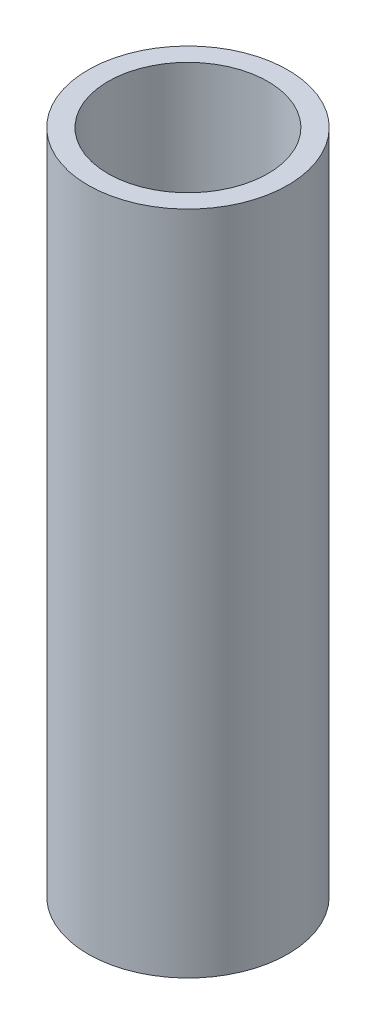
ISO-10303-21;
HEADER;
FILE_DESCRIPTION(('STEP AP214'),'2;1');
FILE_NAME('part.step','',(''),(''),'','','');
FILE_SCHEMA(('AUTOMOTIVE_DESIGN { 1 0 10303 214 1 1 1 1 }'));
ENDSEC;
DATA;
#1=APPLICATION_CONTEXT('core data for automotive mechanical design processes');
#2=APPLICATION_PROTOCOL_DEFINITION('international standard','automotive_design',2000,#1);
#3=PRODUCT_CONTEXT('',#1,'mechanical');
#4=PRODUCT('Part','Part','',(#3));
#5=PRODUCT_RELATED_PRODUCT_CATEGORY('part','',(#4));
#6=PRODUCT_DEFINITION_FORMATION('','',#4);
#7=PRODUCT_DEFINITION_CONTEXT('part definition',#1,'design');
#8=PRODUCT_DEFINITION('design','',#6,#7);
#9=PRODUCT_DEFINITION_SHAPE('','',#8);
#10=(LENGTH_UNIT() NAMED_UNIT(*) SI_UNIT(.MILLI.,.METRE.));
#11=(NAMED_UNIT(*) PLANE_ANGLE_UNIT() SI_UNIT($,.RADIAN.));
#12=(NAMED_UNIT(*) SI_UNIT($,.STERADIAN.) SOLID_ANGLE_UNIT());
#13=UNCERTAINTY_MEASURE_WITH_UNIT(LENGTH_MEASURE(1.E-05),#10,'distance_accuracy_value','');
#14=(GEOMETRIC_REPRESENTATION_CONTEXT(3) GLOBAL_UNCERTAINTY_ASSIGNED_CONTEXT((#13)) GLOBAL_UNIT_ASSIGNED_CONTEXT((#10,
#11,#12)) REPRESENTATION_CONTEXT('',''));
#15=CARTESIAN_POINT('',(0.,0.,0.));
#16=DIRECTION('',(0.,0.,1.));
#17=DIRECTION('',(1.,0.,0.));
#18=AXIS2_PLACEMENT_3D('',#15,#16,#17);
#19=CARTESIAN_POINT('',(0.,100.,0.));
#20=DIRECTION('',(0.,1.,0.));
#21=DIRECTION('',(0.,0.,1.));
#22=AXIS2_PLACEMENT_3D('',#19,#20,#21);
#23=PLANE('',#22);
#24=CARTESIAN_POINT('',(0.,100.,0.));
#25=DIRECTION('',(0.,1.,0.));
#26=DIRECTION('',(0.,0.,1.));
#27=AXIS2_PLACEMENT_3D('',#24,#25,#26);
#28=CIRCLE('',#27,15.);
#29=CARTESIAN_POINT('',(0.,100.,15.));
#30=VERTEX_POINT('',#29);
#31=EDGE_CURVE('E10',#30,#30,#28,.T.);
#32=ORIENTED_EDGE('',*,*,#31,.T.);
#33=EDGE_LOOP('',(#32));
#34=FACE_BOUND('',#33,.T.);
#35=CARTESIAN_POINT('',(0.,100.,0.));
#36=DIRECTION('',(0.,1.,0.));
#37=DIRECTION('',(0.,0.,1.));
#38=AXIS2_PLACEMENT_3D('',#35,#36,#37);
#39=CIRCLE('',#38,12.);
#40=CARTESIAN_POINT('',(0.,100.,12.));
#41=VERTEX_POINT('',#40);
#42=EDGE_CURVE('E54',#41,#41,#39,.T.);
#43=ORIENTED_EDGE('',*,*,#42,.F.);
#44=EDGE_LOOP('',(#43));
#45=FACE_BOUND('',#44,.T.);
#46=ADVANCED_FACE('F41',(#34,#45),#23,.T.);
#47=CARTESIAN_POINT('',(0.,0.,0.));
#48=DIRECTION('',(0.,1.,0.));
#49=DIRECTION('',(0.,0.,1.));
#50=AXIS2_PLACEMENT_3D('',#47,#48,#49);
#51=PLANE('',#50);
#52=CARTESIAN_POINT('',(0.,0.,0.));
#53=DIRECTION('',(0.,1.,0.));
#54=DIRECTION('',(0.,0.,1.));
#55=AXIS2_PLACEMENT_3D('',#52,#53,#54);
#56=CIRCLE('',#55,15.);
#57=CARTESIAN_POINT('',(0.,0.,15.));
#58=VERTEX_POINT('',#57);
#59=EDGE_CURVE('E45',#58,#58,#56,.T.);
#60=ORIENTED_EDGE('',*,*,#59,.F.);
#61=EDGE_LOOP('',(#60));
#62=FACE_BOUND('',#61,.T.);
#63=CARTESIAN_POINT('',(0.,0.,0.));
#64=DIRECTION('',(0.,1.,0.));
#65=DIRECTION('',(0.,0.,1.));
#66=AXIS2_PLACEMENT_3D('',#63,#64,#65);
#67=CIRCLE('',#66,12.);
#68=CARTESIAN_POINT('',(0.,0.,12.));
#69=VERTEX_POINT('',#68);
#70=EDGE_CURVE('E56',#69,#69,#67,.T.);
#71=ORIENTED_EDGE('',*,*,#70,.T.);
#72=EDGE_LOOP('',(#71));
#73=FACE_BOUND('',#72,.T.);
#74=ADVANCED_FACE('F68',(#62,#73),#51,.F.);
#75=CARTESIAN_POINT('',(0.,100.,0.));
#76=DIRECTION('',(0.,-1.,0.));
#77=DIRECTION('',(0.,0.,-1.));
#78=AXIS2_PLACEMENT_3D('',#75,#76,#77);
#79=CYLINDRICAL_SURFACE('',#78,15.);
#80=ORIENTED_EDGE('',*,*,#31,.F.);
#81=EDGE_LOOP('',(#80));
#82=FACE_BOUND('',#81,.T.);
#83=ORIENTED_EDGE('',*,*,#59,.T.);
#84=EDGE_LOOP('',(#83));
#85=FACE_BOUND('',#84,.T.);
#86=ADVANCED_FACE('F43',(#82,#85),#79,.T.);
#87=CARTESIAN_POINT('',(0.,100.,0.));
#88=DIRECTION('',(0.,-1.,0.));
#89=DIRECTION('',(0.,0.,-1.));
#90=AXIS2_PLACEMENT_3D('',#87,#88,#89);
#91=CYLINDRICAL_SURFACE('',#90,12.);
#92=ORIENTED_EDGE('',*,*,#42,.T.);
#93=EDGE_LOOP('',(#92));
#94=FACE_BOUND('',#93,.T.);
#95=ORIENTED_EDGE('',*,*,#70,.F.);
#96=EDGE_LOOP('',(#95));
#97=FACE_BOUND('',#96,.T.);
#98=ADVANCED_FACE('F64',(#94,#97),#91,.F.);
#99=CLOSED_SHELL('',(#46,#74,#86,#98));
#100=MANIFOLD_SOLID_BREP('B2',#99);
#101=ADVANCED_BREP_SHAPE_REPRESENTATION('',(#18,#100),#14);
#102=SHAPE_DEFINITION_REPRESENTATION(#9,#101);
ENDSEC;
END-ISO-10303-21;
